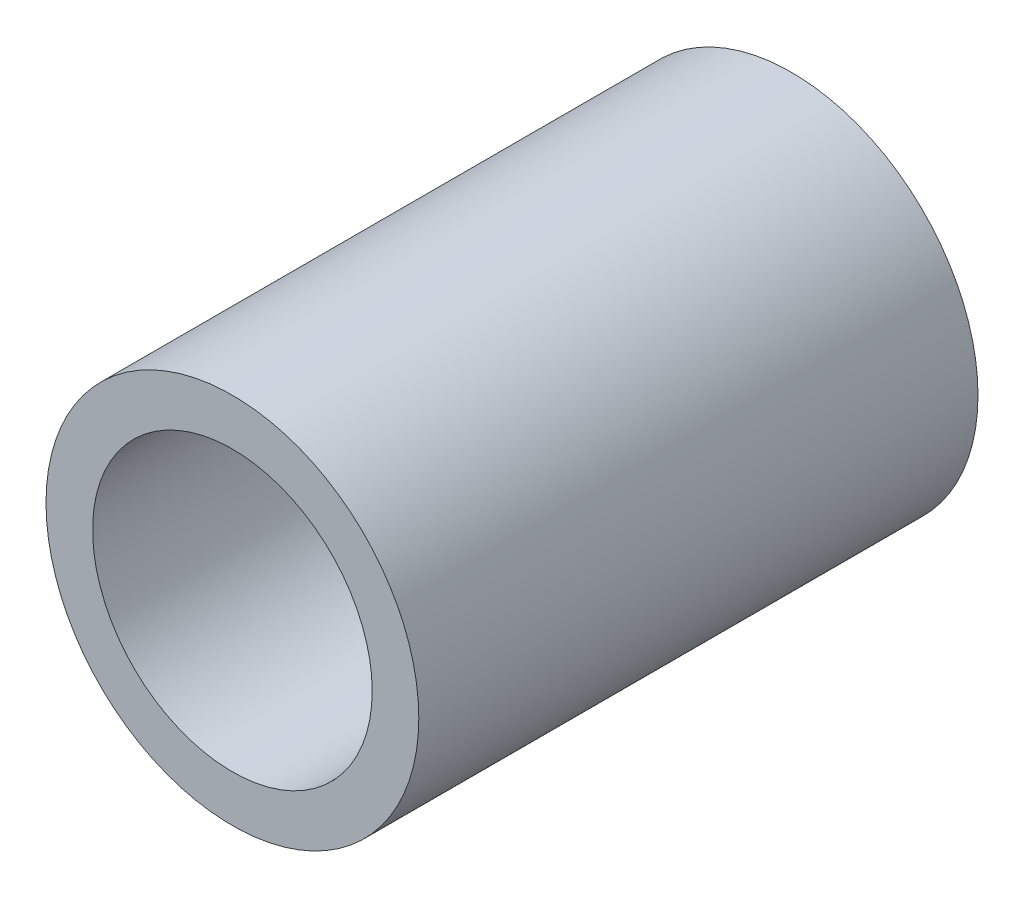
ISO-10303-21;
HEADER;
FILE_DESCRIPTION(('STEP AP214'),'2;1');
FILE_NAME('part.step','',(''),(''),'','','');
FILE_SCHEMA(('AUTOMOTIVE_DESIGN { 1 0 10303 214 1 1 1 1 }'));
ENDSEC;
DATA;
#1=APPLICATION_CONTEXT('core data for automotive mechanical design processes');
#2=APPLICATION_PROTOCOL_DEFINITION('international standard','automotive_design',2000,#1);
#3=PRODUCT_CONTEXT('',#1,'mechanical');
#4=PRODUCT('Part','Part','',(#3));
#5=PRODUCT_RELATED_PRODUCT_CATEGORY('part','',(#4));
#6=PRODUCT_DEFINITION_FORMATION('','',#4);
#7=PRODUCT_DEFINITION_CONTEXT('part definition',#1,'design');
#8=PRODUCT_DEFINITION('design','',#6,#7);
#9=PRODUCT_DEFINITION_SHAPE('','',#8);
#10=(LENGTH_UNIT() NAMED_UNIT(*) SI_UNIT(.MILLI.,.METRE.));
#11=(NAMED_UNIT(*) PLANE_ANGLE_UNIT() SI_UNIT($,.RADIAN.));
#12=(NAMED_UNIT(*) SI_UNIT($,.STERADIAN.) SOLID_ANGLE_UNIT());
#13=UNCERTAINTY_MEASURE_WITH_UNIT(LENGTH_MEASURE(1.E-05),#10,'distance_accuracy_value','');
#14=(GEOMETRIC_REPRESENTATION_CONTEXT(3) GLOBAL_UNCERTAINTY_ASSIGNED_CONTEXT((#13)) GLOBAL_UNIT_ASSIGNED_CONTEXT((#10,
#11,#12)) REPRESENTATION_CONTEXT('',''));
#15=CARTESIAN_POINT('',(0.,0.,0.));
#16=DIRECTION('',(0.,0.,1.));
#17=DIRECTION('',(1.,0.,0.));
#18=AXIS2_PLACEMENT_3D('',#15,#16,#17);
#19=CARTESIAN_POINT('',(0.,0.,60.));
#20=DIRECTION('',(0.,0.,-1.));
#21=DIRECTION('',(-1.,0.,0.));
#22=AXIS2_PLACEMENT_3D('',#19,#20,#21);
#23=CYLINDRICAL_SURFACE('',#22,20.);
#24=CARTESIAN_POINT('',(0.,0.,60.));
#25=DIRECTION('',(0.,0.,1.));
#26=DIRECTION('',(1.,0.,0.));
#27=AXIS2_PLACEMENT_3D('',#24,#25,#26);
#28=CIRCLE('',#27,20.);
#29=CARTESIAN_POINT('',(20.,0.,60.));
#30=VERTEX_POINT('',#29);
#31=EDGE_CURVE('E10',#30,#30,#28,.T.);
#32=ORIENTED_EDGE('',*,*,#31,.F.);
#33=EDGE_LOOP('',(#32));
#34=FACE_BOUND('',#33,.T.);
#35=CARTESIAN_POINT('',(0.,0.,0.));
#36=DIRECTION('',(0.,0.,1.));
#37=DIRECTION('',(1.,0.,0.));
#38=AXIS2_PLACEMENT_3D('',#35,#36,#37);
#39=CIRCLE('',#38,20.);
#40=CARTESIAN_POINT('',(20.,0.,0.));
#41=VERTEX_POINT('',#40);
#42=EDGE_CURVE('E40',#41,#41,#39,.T.);
#43=ORIENTED_EDGE('',*,*,#42,.T.);
#44=EDGE_LOOP('',(#43));
#45=FACE_BOUND('',#44,.T.);
#46=ADVANCED_FACE('F37',(#34,#45),#23,.T.);
#47=CARTESIAN_POINT('',(0.,0.,60.));
#48=DIRECTION('',(0.,0.,1.));
#49=DIRECTION('',(1.,0.,0.));
#50=AXIS2_PLACEMENT_3D('',#47,#48,#49);
#51=PLANE('',#50);
#52=CARTESIAN_POINT('',(0.,0.,60.));
#53=DIRECTION('',(0.,0.,1.));
#54=DIRECTION('',(1.,0.,0.));
#55=AXIS2_PLACEMENT_3D('',#52,#53,#54);
#56=CIRCLE('',#55,15.);
#57=CARTESIAN_POINT('',(15.,0.,60.));
#58=VERTEX_POINT('',#57);
#59=EDGE_CURVE('E51',#58,#58,#56,.T.);
#60=ORIENTED_EDGE('',*,*,#59,.F.);
#61=EDGE_LOOP('',(#60));
#62=FACE_BOUND('',#61,.T.);
#63=ORIENTED_EDGE('',*,*,#31,.T.);
#64=EDGE_LOOP('',(#63));
#65=FACE_BOUND('',#64,.T.);
#66=ADVANCED_FACE('F68',(#62,#65),#51,.T.);
#67=CARTESIAN_POINT('',(0.,0.,0.));
#68=DIRECTION('',(0.,0.,1.));
#69=DIRECTION('',(1.,0.,0.));
#70=AXIS2_PLACEMENT_3D('',#67,#68,#69);
#71=PLANE('',#70);
#72=ORIENTED_EDGE('',*,*,#42,.F.);
#73=EDGE_LOOP('',(#72));
#74=FACE_BOUND('',#73,.T.);
#75=ADVANCED_FACE('F64',(#74),#71,.F.);
#76=CARTESIAN_POINT('',(0.,0.,1.99999999999999));
#77=DIRECTION('',(0.,0.,1.));
#78=DIRECTION('',(1.,0.,0.));
#79=AXIS2_PLACEMENT_3D('',#76,#77,#78);
#80=CYLINDRICAL_SURFACE('',#79,15.);
#81=CARTESIAN_POINT('',(0.,0.,1.99999999999999));
#82=DIRECTION('',(0.,0.,1.));
#83=DIRECTION('',(1.,0.,0.));
#84=AXIS2_PLACEMENT_3D('',#81,#82,#83);
#85=CIRCLE('',#84,15.);
#86=CARTESIAN_POINT('',(15.,0.,1.99999999999999));
#87=VERTEX_POINT('',#86);
#88=EDGE_CURVE('E49',#87,#87,#85,.T.);
#89=ORIENTED_EDGE('',*,*,#88,.F.);
#90=EDGE_LOOP('',(#89));
#91=FACE_BOUND('',#90,.T.);
#92=ORIENTED_EDGE('',*,*,#59,.T.);
#93=EDGE_LOOP('',(#92));
#94=FACE_BOUND('',#93,.T.);
#95=ADVANCED_FACE('F61',(#91,#94),#80,.F.);
#96=CARTESIAN_POINT('',(0.,0.,1.99999999999999));
#97=DIRECTION('',(0.,0.,1.));
#98=DIRECTION('',(1.,0.,0.));
#99=AXIS2_PLACEMENT_3D('',#96,#97,#98);
#100=PLANE('',#99);
#101=ORIENTED_EDGE('',*,*,#88,.T.);
#102=EDGE_LOOP('',(#101));
#103=FACE_BOUND('',#102,.T.);
#104=ADVANCED_FACE('F59',(#103),#100,.T.);
#105=CLOSED_SHELL('',(#46,#66,#75,#95,#104));
#106=MANIFOLD_SOLID_BREP('B2',#105);
#107=ADVANCED_BREP_SHAPE_REPRESENTATION('',(#18,#106),#14);
#108=SHAPE_DEFINITION_REPRESENTATION(#9,#107);
ENDSEC;
END-ISO-10303-21;
